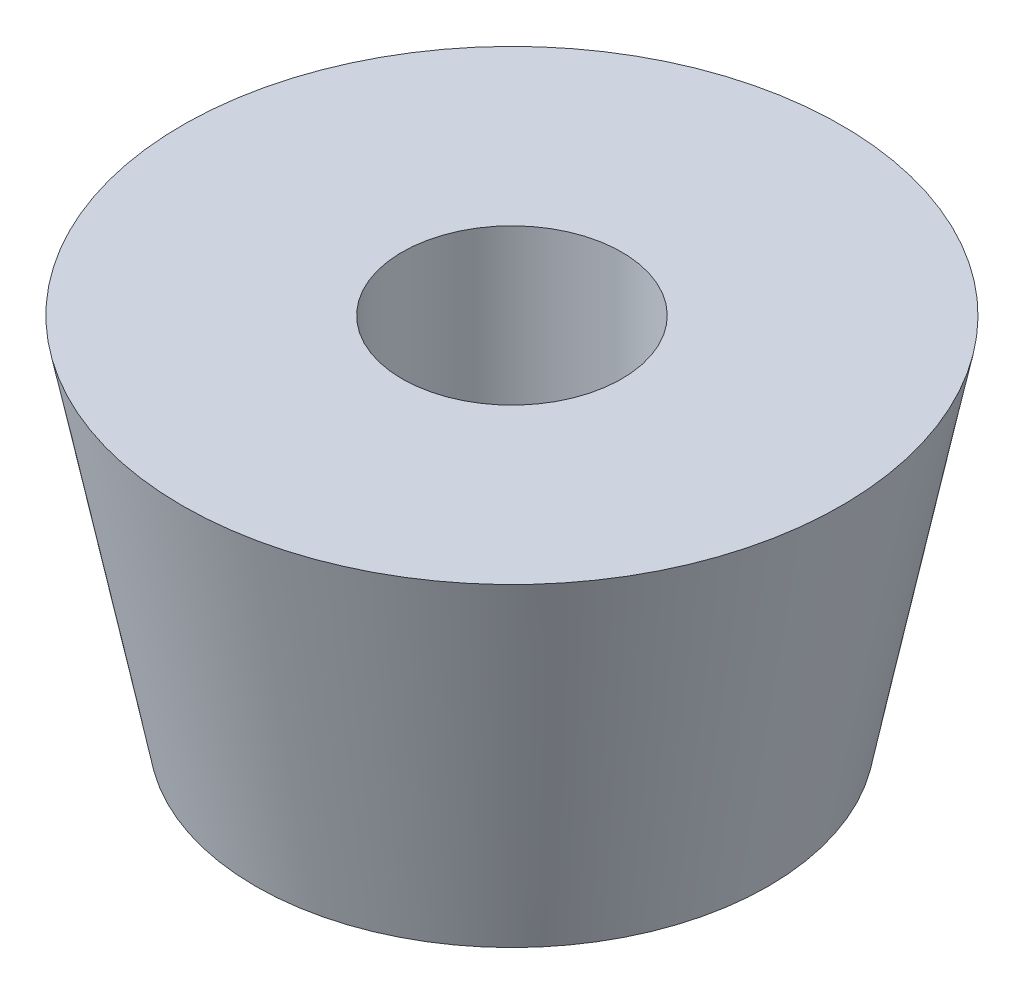
ISO-10303-21;
HEADER;
FILE_DESCRIPTION(('STEP AP214'),'2;1');
FILE_NAME('part.step','',(''),(''),'','','');
FILE_SCHEMA(('AUTOMOTIVE_DESIGN { 1 0 10303 214 1 1 1 1 }'));
ENDSEC;
DATA;
#1=APPLICATION_CONTEXT('core data for automotive mechanical design processes');
#2=APPLICATION_PROTOCOL_DEFINITION('international standard','automotive_design',2000,#1);
#3=PRODUCT_CONTEXT('',#1,'mechanical');
#4=PRODUCT('Part','Part','',(#3));
#5=PRODUCT_RELATED_PRODUCT_CATEGORY('part','',(#4));
#6=PRODUCT_DEFINITION_FORMATION('','',#4);
#7=PRODUCT_DEFINITION_CONTEXT('part definition',#1,'design');
#8=PRODUCT_DEFINITION('design','',#6,#7);
#9=PRODUCT_DEFINITION_SHAPE('','',#8);
#10=(LENGTH_UNIT() NAMED_UNIT(*) SI_UNIT(.MILLI.,.METRE.));
#11=(NAMED_UNIT(*) PLANE_ANGLE_UNIT() SI_UNIT($,.RADIAN.));
#12=(NAMED_UNIT(*) SI_UNIT($,.STERADIAN.) SOLID_ANGLE_UNIT());
#13=UNCERTAINTY_MEASURE_WITH_UNIT(LENGTH_MEASURE(1.E-05),#10,'distance_accuracy_value','');
#14=(GEOMETRIC_REPRESENTATION_CONTEXT(3) GLOBAL_UNCERTAINTY_ASSIGNED_CONTEXT((#13)) GLOBAL_UNIT_ASSIGNED_CONTEXT((#10,
#11,#12)) REPRESENTATION_CONTEXT('',''));
#15=CARTESIAN_POINT('',(0.,0.,0.));
#16=DIRECTION('',(0.,0.,1.));
#17=DIRECTION('',(1.,0.,0.));
#18=AXIS2_PLACEMENT_3D('',#15,#16,#17);
#19=CARTESIAN_POINT('',(0.,0.,-4.5));
#20=DIRECTION('',(0.,-1.,0.));
#21=DIRECTION('',(0.,0.,-1.));
#22=AXIS2_PLACEMENT_3D('',#19,#20,#21);
#23=PLANE('',#22);
#24=CARTESIAN_POINT('',(0.,0.,0.));
#25=DIRECTION('',(0.,1.,0.));
#26=DIRECTION('',(0.,0.,1.));
#27=AXIS2_PLACEMENT_3D('',#24,#25,#26);
#28=CIRCLE('',#27,1.5);
#29=CARTESIAN_POINT('',(0.,0.,1.5));
#30=VERTEX_POINT('',#29);
#31=EDGE_CURVE('E10',#30,#30,#28,.T.);
#32=ORIENTED_EDGE('',*,*,#31,.F.);
#33=EDGE_LOOP('',(#32));
#34=FACE_BOUND('',#33,.T.);
#35=CARTESIAN_POINT('',(0.,0.,0.));
#36=DIRECTION('',(0.,1.,0.));
#37=DIRECTION('',(0.,0.,1.));
#38=AXIS2_PLACEMENT_3D('',#35,#36,#37);
#39=CIRCLE('',#38,4.5);
#40=CARTESIAN_POINT('',(0.,0.,4.5));
#41=VERTEX_POINT('',#40);
#42=EDGE_CURVE('E46',#41,#41,#39,.T.);
#43=ORIENTED_EDGE('',*,*,#42,.T.);
#44=EDGE_LOOP('',(#43));
#45=FACE_BOUND('',#44,.T.);
#46=ADVANCED_FACE('F32',(#34,#45),#23,.F.);
#47=CARTESIAN_POINT('',(0.,0.,0.));
#48=DIRECTION('',(0.,1.,0.));
#49=DIRECTION('',(0.,0.,1.));
#50=AXIS2_PLACEMENT_3D('',#47,#48,#49);
#51=CYLINDRICAL_SURFACE('',#50,1.5);
#52=CARTESIAN_POINT('',(0.,-5.,0.));
#53=DIRECTION('',(0.,1.,0.));
#54=DIRECTION('',(0.,0.,1.));
#55=AXIS2_PLACEMENT_3D('',#52,#53,#54);
#56=CIRCLE('',#55,1.5);
#57=CARTESIAN_POINT('',(0.,-5.,1.5));
#58=VERTEX_POINT('',#57);
#59=EDGE_CURVE('E38',#58,#58,#56,.T.);
#60=ORIENTED_EDGE('',*,*,#59,.F.);
#61=EDGE_LOOP('',(#60));
#62=FACE_BOUND('',#61,.T.);
#63=ORIENTED_EDGE('',*,*,#31,.T.);
#64=EDGE_LOOP('',(#63));
#65=FACE_BOUND('',#64,.T.);
#66=ADVANCED_FACE('F61',(#62,#65),#51,.F.);
#67=CARTESIAN_POINT('',(0.,-5.,-1.5));
#68=DIRECTION('',(0.,1.,0.));
#69=DIRECTION('',(0.,0.,1.));
#70=AXIS2_PLACEMENT_3D('',#67,#68,#69);
#71=PLANE('',#70);
#72=CARTESIAN_POINT('',(0.,-5.,0.));
#73=DIRECTION('',(0.,1.,0.));
#74=DIRECTION('',(0.,0.,1.));
#75=AXIS2_PLACEMENT_3D('',#72,#73,#74);
#76=CIRCLE('',#75,3.5);
#77=CARTESIAN_POINT('',(0.,-5.,3.5));
#78=VERTEX_POINT('',#77);
#79=EDGE_CURVE('E42',#78,#78,#76,.T.);
#80=ORIENTED_EDGE('',*,*,#79,.F.);
#81=EDGE_LOOP('',(#80));
#82=FACE_BOUND('',#81,.T.);
#83=ORIENTED_EDGE('',*,*,#59,.T.);
#84=EDGE_LOOP('',(#83));
#85=FACE_BOUND('',#84,.T.);
#86=ADVANCED_FACE('F56',(#82,#85),#71,.F.);
#87=CARTESIAN_POINT('',(0.,-5.,0.));
#88=DIRECTION('',(0.,1.,0.));
#89=DIRECTION('',(0.,0.,1.));
#90=AXIS2_PLACEMENT_3D('',#87,#88,#89);
#91=CONICAL_SURFACE('',#90,3.5,0.197395559849881);
#92=ORIENTED_EDGE('',*,*,#42,.F.);
#93=EDGE_LOOP('',(#92));
#94=FACE_BOUND('',#93,.T.);
#95=ORIENTED_EDGE('',*,*,#79,.T.);
#96=EDGE_LOOP('',(#95));
#97=FACE_BOUND('',#96,.T.);
#98=ADVANCED_FACE('F53',(#94,#97),#91,.T.);
#99=CLOSED_SHELL('',(#46,#66,#86,#98));
#100=MANIFOLD_SOLID_BREP('B2',#99);
#101=ADVANCED_BREP_SHAPE_REPRESENTATION('',(#18,#100),#14);
#102=SHAPE_DEFINITION_REPRESENTATION(#9,#101);
ENDSEC;
END-ISO-10303-21;
